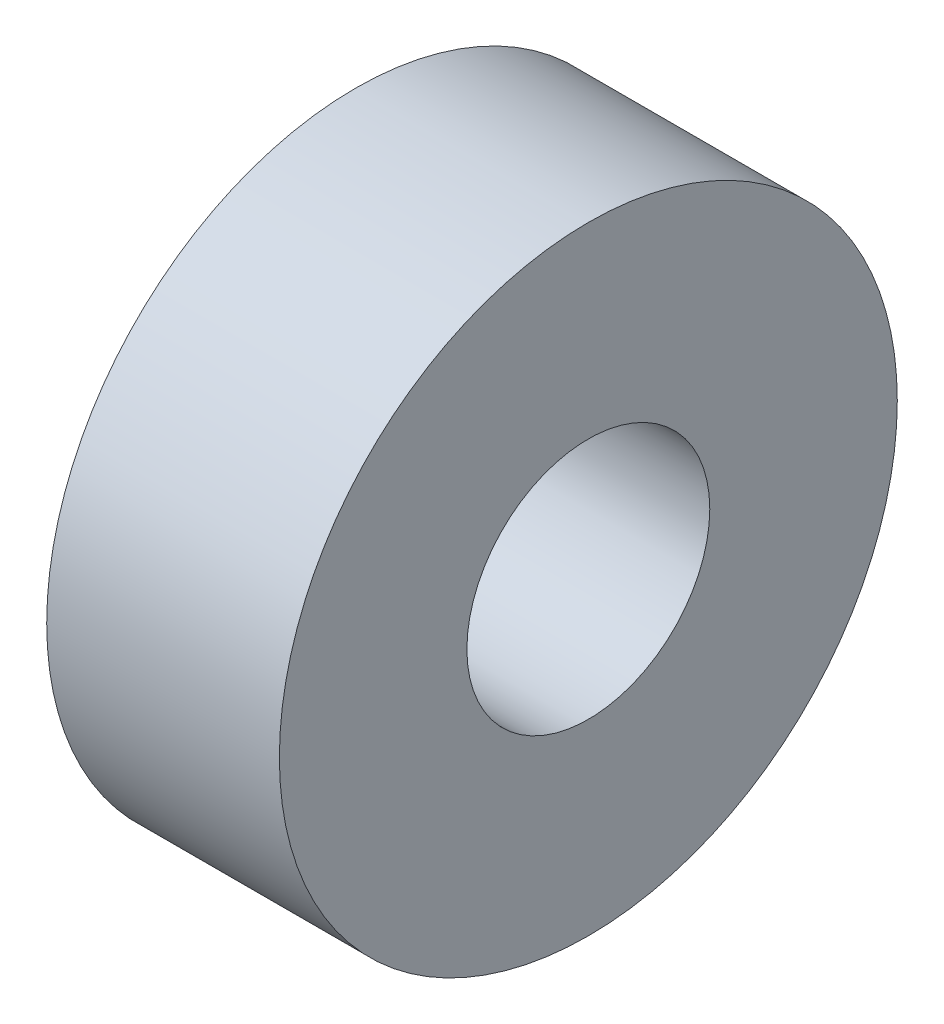
ISO-10303-21;
HEADER;
FILE_DESCRIPTION(('STEP AP214'),'2;1');
FILE_NAME('part.step','',(''),(''),'','','');
FILE_SCHEMA(('AUTOMOTIVE_DESIGN { 1 0 10303 214 1 1 1 1 }'));
ENDSEC;
DATA;
#1=APPLICATION_CONTEXT('core data for automotive mechanical design processes');
#2=APPLICATION_PROTOCOL_DEFINITION('international standard','automotive_design',2000,#1);
#3=PRODUCT_CONTEXT('',#1,'mechanical');
#4=PRODUCT('Part','Part','',(#3));
#5=PRODUCT_RELATED_PRODUCT_CATEGORY('part','',(#4));
#6=PRODUCT_DEFINITION_FORMATION('','',#4);
#7=PRODUCT_DEFINITION_CONTEXT('part definition',#1,'design');
#8=PRODUCT_DEFINITION('design','',#6,#7);
#9=PRODUCT_DEFINITION_SHAPE('','',#8);
#10=(LENGTH_UNIT() NAMED_UNIT(*) SI_UNIT(.MILLI.,.METRE.));
#11=(NAMED_UNIT(*) PLANE_ANGLE_UNIT() SI_UNIT($,.RADIAN.));
#12=(NAMED_UNIT(*) SI_UNIT($,.STERADIAN.) SOLID_ANGLE_UNIT());
#13=UNCERTAINTY_MEASURE_WITH_UNIT(LENGTH_MEASURE(1.E-05),#10,'distance_accuracy_value','');
#14=(GEOMETRIC_REPRESENTATION_CONTEXT(3) GLOBAL_UNCERTAINTY_ASSIGNED_CONTEXT((#13)) GLOBAL_UNIT_ASSIGNED_CONTEXT((#10,
#11,#12)) REPRESENTATION_CONTEXT('',''));
#15=CARTESIAN_POINT('',(0.,0.,0.));
#16=DIRECTION('',(0.,0.,1.));
#17=DIRECTION('',(1.,0.,0.));
#18=AXIS2_PLACEMENT_3D('',#15,#16,#17);
#19=CARTESIAN_POINT('',(0.,0.,0.));
#20=DIRECTION('',(1.,0.,0.));
#21=DIRECTION('',(0.,0.,-1.));
#22=AXIS2_PLACEMENT_3D('',#19,#20,#21);
#23=PLANE('',#22);
#24=CARTESIAN_POINT('',(0.,0.,0.));
#25=DIRECTION('',(-1.,0.,0.));
#26=DIRECTION('',(0.,0.,1.));
#27=AXIS2_PLACEMENT_3D('',#24,#25,#26);
#28=CIRCLE('',#27,1.5875);
#29=CARTESIAN_POINT('',(0.,0.,1.5875));
#30=VERTEX_POINT('',#29);
#31=EDGE_CURVE('E27',#30,#30,#28,.F.);
#32=ORIENTED_EDGE('',*,*,#31,.T.);
#33=EDGE_LOOP('',(#32));
#34=FACE_BOUND('',#33,.T.);
#35=CARTESIAN_POINT('',(0.,0.,0.));
#36=DIRECTION('',(-1.,0.,0.));
#37=DIRECTION('',(0.,0.,1.));
#38=AXIS2_PLACEMENT_3D('',#35,#36,#37);
#39=CIRCLE('',#38,4.0386);
#40=CARTESIAN_POINT('',(0.,0.,4.0386));
#41=VERTEX_POINT('',#40);
#42=EDGE_CURVE('E18',#41,#41,#39,.F.);
#43=ORIENTED_EDGE('',*,*,#42,.F.);
#44=EDGE_LOOP('',(#43));
#45=FACE_BOUND('',#44,.T.);
#46=ADVANCED_FACE('F15',(#34,#45),#23,.F.);
#47=CARTESIAN_POINT('',(3.04124106,0.,0.));
#48=DIRECTION('',(-1.,0.,0.));
#49=DIRECTION('',(0.,0.,1.));
#50=AXIS2_PLACEMENT_3D('',#47,#48,#49);
#51=CYLINDRICAL_SURFACE('',#50,4.0386);
#52=ORIENTED_EDGE('',*,*,#42,.T.);
#53=EDGE_LOOP('',(#52));
#54=FACE_BOUND('',#53,.T.);
#55=CARTESIAN_POINT('',(3.04124106,0.,0.));
#56=DIRECTION('',(-1.,0.,0.));
#57=DIRECTION('',(0.,0.,1.));
#58=AXIS2_PLACEMENT_3D('',#55,#56,#57);
#59=CIRCLE('',#58,4.0386);
#60=CARTESIAN_POINT('',(3.04124106,0.,4.0386));
#61=VERTEX_POINT('',#60);
#62=EDGE_CURVE('E22',#61,#61,#59,.F.);
#63=ORIENTED_EDGE('',*,*,#62,.F.);
#64=EDGE_LOOP('',(#63));
#65=FACE_BOUND('',#64,.T.);
#66=ADVANCED_FACE('F35',(#54,#65),#51,.T.);
#67=CARTESIAN_POINT('',(3.04124106,0.,0.));
#68=DIRECTION('',(-1.,0.,0.));
#69=DIRECTION('',(0.,0.,1.));
#70=AXIS2_PLACEMENT_3D('',#67,#68,#69);
#71=CYLINDRICAL_SURFACE('',#70,1.5875);
#72=CARTESIAN_POINT('',(3.04124106,0.,0.));
#73=DIRECTION('',(-1.,0.,0.));
#74=DIRECTION('',(0.,0.,1.));
#75=AXIS2_PLACEMENT_3D('',#72,#73,#74);
#76=CIRCLE('',#75,1.5875);
#77=CARTESIAN_POINT('',(3.04124106,0.,1.5875));
#78=VERTEX_POINT('',#77);
#79=EDGE_CURVE('E10',#78,#78,#76,.T.);
#80=ORIENTED_EDGE('',*,*,#79,.F.);
#81=EDGE_LOOP('',(#80));
#82=FACE_BOUND('',#81,.T.);
#83=ORIENTED_EDGE('',*,*,#31,.F.);
#84=EDGE_LOOP('',(#83));
#85=FACE_BOUND('',#84,.T.);
#86=ADVANCED_FACE('F43',(#82,#85),#71,.F.);
#87=CARTESIAN_POINT('',(3.04124106,0.,0.));
#88=DIRECTION('',(1.,0.,0.));
#89=DIRECTION('',(0.,0.,-1.));
#90=AXIS2_PLACEMENT_3D('',#87,#88,#89);
#91=PLANE('',#90);
#92=ORIENTED_EDGE('',*,*,#79,.T.);
#93=EDGE_LOOP('',(#92));
#94=FACE_BOUND('',#93,.T.);
#95=ORIENTED_EDGE('',*,*,#62,.T.);
#96=EDGE_LOOP('',(#95));
#97=FACE_BOUND('',#96,.T.);
#98=ADVANCED_FACE('F44',(#94,#97),#91,.T.);
#99=CLOSED_SHELL('',(#46,#66,#86,#98));
#100=MANIFOLD_SOLID_BREP('B1',#99);
#101=ADVANCED_BREP_SHAPE_REPRESENTATION('',(#18,#100),#14);
#102=SHAPE_DEFINITION_REPRESENTATION(#9,#101);
ENDSEC;
END-ISO-10303-21;
